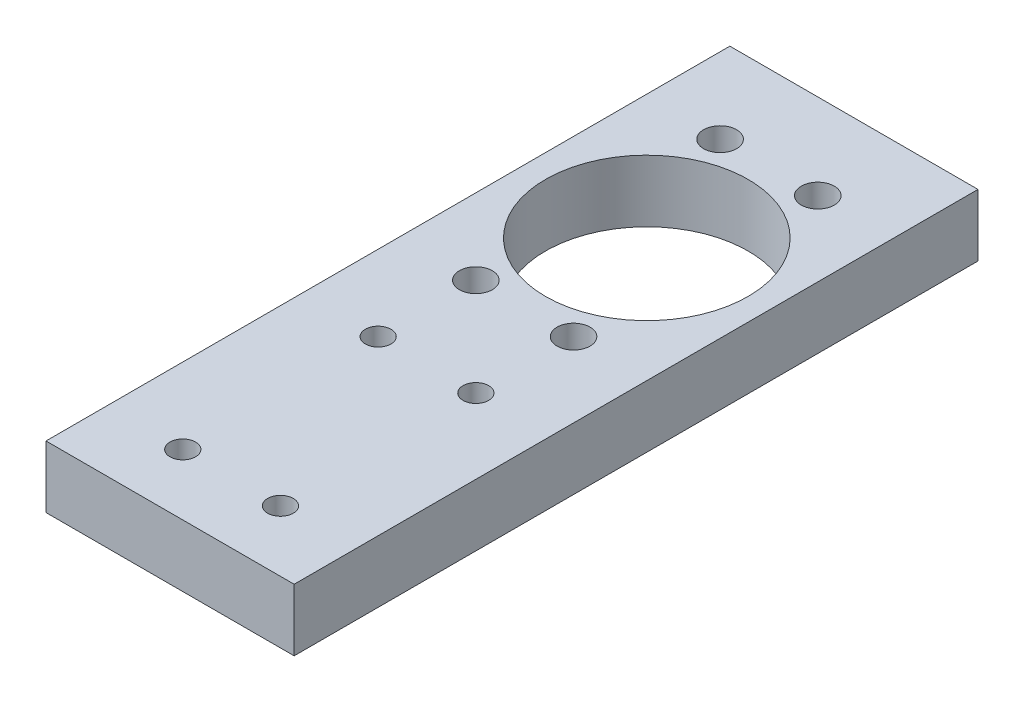
ISO-10303-21;
HEADER;
FILE_DESCRIPTION(('STEP AP214'),'2;1');
FILE_NAME('part.step','',(''),(''),'','','');
FILE_SCHEMA(('AUTOMOTIVE_DESIGN { 1 0 10303 214 1 1 1 1 }'));
ENDSEC;
DATA;
#1=APPLICATION_CONTEXT('core data for automotive mechanical design processes');
#2=APPLICATION_PROTOCOL_DEFINITION('international standard','automotive_design',2000,#1);
#3=PRODUCT_CONTEXT('',#1,'mechanical');
#4=PRODUCT('Part','Part','',(#3));
#5=PRODUCT_RELATED_PRODUCT_CATEGORY('part','',(#4));
#6=PRODUCT_DEFINITION_FORMATION('','',#4);
#7=PRODUCT_DEFINITION_CONTEXT('part definition',#1,'design');
#8=PRODUCT_DEFINITION('design','',#6,#7);
#9=PRODUCT_DEFINITION_SHAPE('','',#8);
#10=(LENGTH_UNIT() NAMED_UNIT(*) SI_UNIT(.MILLI.,.METRE.));
#11=(NAMED_UNIT(*) PLANE_ANGLE_UNIT() SI_UNIT($,.RADIAN.));
#12=(NAMED_UNIT(*) SI_UNIT($,.STERADIAN.) SOLID_ANGLE_UNIT());
#13=UNCERTAINTY_MEASURE_WITH_UNIT(LENGTH_MEASURE(1.E-05),#10,'distance_accuracy_value','');
#14=(GEOMETRIC_REPRESENTATION_CONTEXT(3) GLOBAL_UNCERTAINTY_ASSIGNED_CONTEXT((#13)) GLOBAL_UNIT_ASSIGNED_CONTEXT((#10,
#11,#12)) REPRESENTATION_CONTEXT('',''));
#15=CARTESIAN_POINT('',(0.,0.,0.));
#16=DIRECTION('',(0.,0.,1.));
#17=DIRECTION('',(1.,0.,0.));
#18=AXIS2_PLACEMENT_3D('',#15,#16,#17);
#19=CARTESIAN_POINT('',(0.,25.4,0.));
#20=DIRECTION('',(1.,0.,0.));
#21=DIRECTION('',(0.,0.,-1.));
#22=AXIS2_PLACEMENT_3D('',#19,#20,#21);
#23=PLANE('',#22);
#24=DIRECTION('',(0.,0.,1.));
#25=VECTOR('',#24,1.);
#26=CARTESIAN_POINT('',(0.,0.,0.));
#27=LINE('',#26,#25);
#28=CARTESIAN_POINT('',(0.,0.,-280.));
#29=VERTEX_POINT('',#28);
#30=CARTESIAN_POINT('',(0.,0.,0.));
#31=VERTEX_POINT('',#30);
#32=EDGE_CURVE('E96',#29,#31,#27,.T.);
#33=ORIENTED_EDGE('',*,*,#32,.T.);
#34=DIRECTION('',(0.,-1.,0.));
#35=VECTOR('',#34,1.);
#36=CARTESIAN_POINT('',(0.,25.4,0.));
#37=LINE('',#36,#35);
#38=CARTESIAN_POINT('',(0.,25.4,0.));
#39=VERTEX_POINT('',#38);
#40=EDGE_CURVE('E11',#39,#31,#37,.T.);
#41=ORIENTED_EDGE('',*,*,#40,.F.);
#42=DIRECTION('',(0.,0.,1.));
#43=VECTOR('',#42,1.);
#44=CARTESIAN_POINT('',(0.,25.4,0.));
#45=LINE('',#44,#43);
#46=CARTESIAN_POINT('',(0.,25.4,-280.));
#47=VERTEX_POINT('',#46);
#48=EDGE_CURVE('E84',#47,#39,#45,.T.);
#49=ORIENTED_EDGE('',*,*,#48,.F.);
#50=DIRECTION('',(0.,-1.,0.));
#51=VECTOR('',#50,1.);
#52=CARTESIAN_POINT('',(0.,25.4,-280.));
#53=LINE('',#52,#51);
#54=EDGE_CURVE('E92',#47,#29,#53,.T.);
#55=ORIENTED_EDGE('',*,*,#54,.T.);
#56=EDGE_LOOP('',(#33,#41,#49,#55));
#57=FACE_BOUND('',#56,.T.);
#58=ADVANCED_FACE('F33',(#57),#23,.F.);
#59=CARTESIAN_POINT('',(0.,25.4,0.));
#60=DIRECTION('',(0.,0.,-1.));
#61=DIRECTION('',(-1.,0.,0.));
#62=AXIS2_PLACEMENT_3D('',#59,#60,#61);
#63=PLANE('',#62);
#64=DIRECTION('',(1.,0.,0.));
#65=VECTOR('',#64,1.);
#66=CARTESIAN_POINT('',(0.,0.,0.));
#67=LINE('',#66,#65);
#68=CARTESIAN_POINT('',(101.6,0.,0.));
#69=VERTEX_POINT('',#68);
#70=EDGE_CURVE('E88',#31,#69,#67,.T.);
#71=ORIENTED_EDGE('',*,*,#70,.T.);
#72=DIRECTION('',(0.,-1.,0.));
#73=VECTOR('',#72,1.);
#74=CARTESIAN_POINT('',(101.6,25.4,0.));
#75=LINE('',#74,#73);
#76=CARTESIAN_POINT('',(101.6,25.4,0.));
#77=VERTEX_POINT('',#76);
#78=EDGE_CURVE('E41',#77,#69,#75,.T.);
#79=ORIENTED_EDGE('',*,*,#78,.F.);
#80=DIRECTION('',(1.,0.,0.));
#81=VECTOR('',#80,1.);
#82=CARTESIAN_POINT('',(0.,25.4,0.));
#83=LINE('',#82,#81);
#84=EDGE_CURVE('E79',#39,#77,#83,.T.);
#85=ORIENTED_EDGE('',*,*,#84,.F.);
#86=ORIENTED_EDGE('',*,*,#40,.T.);
#87=EDGE_LOOP('',(#71,#79,#85,#86));
#88=FACE_BOUND('',#87,.T.);
#89=ADVANCED_FACE('F87',(#88),#63,.F.);
#90=CARTESIAN_POINT('',(101.6,25.4,0.));
#91=DIRECTION('',(-1.,0.,0.));
#92=DIRECTION('',(0.,0.,1.));
#93=AXIS2_PLACEMENT_3D('',#90,#91,#92);
#94=PLANE('',#93);
#95=DIRECTION('',(0.,0.,-1.));
#96=VECTOR('',#95,1.);
#97=CARTESIAN_POINT('',(101.6,0.,0.));
#98=LINE('',#97,#96);
#99=CARTESIAN_POINT('',(101.6,0.,-280.));
#100=VERTEX_POINT('',#99);
#101=EDGE_CURVE('E66',#69,#100,#98,.T.);
#102=ORIENTED_EDGE('',*,*,#101,.T.);
#103=DIRECTION('',(0.,-1.,0.));
#104=VECTOR('',#103,1.);
#105=CARTESIAN_POINT('',(101.6,25.4,-280.));
#106=LINE('',#105,#104);
#107=CARTESIAN_POINT('',(101.6,25.4,-280.));
#108=VERTEX_POINT('',#107);
#109=EDGE_CURVE('E89',#108,#100,#106,.T.);
#110=ORIENTED_EDGE('',*,*,#109,.F.);
#111=DIRECTION('',(0.,0.,-1.));
#112=VECTOR('',#111,1.);
#113=CARTESIAN_POINT('',(101.6,25.4,0.));
#114=LINE('',#113,#112);
#115=EDGE_CURVE('E82',#77,#108,#114,.T.);
#116=ORIENTED_EDGE('',*,*,#115,.F.);
#117=ORIENTED_EDGE('',*,*,#78,.T.);
#118=EDGE_LOOP('',(#102,#110,#116,#117));
#119=FACE_BOUND('',#118,.T.);
#120=ADVANCED_FACE('F90',(#119),#94,.F.);
#121=CARTESIAN_POINT('',(0.,25.4,-280.));
#122=DIRECTION('',(0.,0.,1.));
#123=DIRECTION('',(1.,0.,0.));
#124=AXIS2_PLACEMENT_3D('',#121,#122,#123);
#125=PLANE('',#124);
#126=DIRECTION('',(-1.,0.,0.));
#127=VECTOR('',#126,1.);
#128=CARTESIAN_POINT('',(0.,0.,-280.));
#129=LINE('',#128,#127);
#130=EDGE_CURVE('E72',#100,#29,#129,.T.);
#131=ORIENTED_EDGE('',*,*,#130,.T.);
#132=ORIENTED_EDGE('',*,*,#54,.F.);
#133=DIRECTION('',(-1.,0.,0.));
#134=VECTOR('',#133,1.);
#135=CARTESIAN_POINT('',(0.,25.4,-280.));
#136=LINE('',#135,#134);
#137=EDGE_CURVE('E49',#108,#47,#136,.T.);
#138=ORIENTED_EDGE('',*,*,#137,.F.);
#139=ORIENTED_EDGE('',*,*,#109,.T.);
#140=EDGE_LOOP('',(#131,#132,#138,#139));
#141=FACE_BOUND('',#140,.T.);
#142=ADVANCED_FACE('F104',(#141),#125,.F.);
#143=CARTESIAN_POINT('',(0.,25.4,-280.));
#144=DIRECTION('',(0.,-1.,0.));
#145=DIRECTION('',(0.,0.,-1.));
#146=AXIS2_PLACEMENT_3D('',#143,#144,#145);
#147=PLANE('',#146);
#148=CARTESIAN_POINT('',(31.,25.4,-25.));
#149=DIRECTION('',(0.,1.,0.));
#150=DIRECTION('',(0.,0.,1.));
#151=AXIS2_PLACEMENT_3D('',#148,#149,#150);
#152=CIRCLE('',#151,5.25);
#153=CARTESIAN_POINT('',(31.,25.4,-19.75));
#154=VERTEX_POINT('',#153);
#155=EDGE_CURVE('E155',#154,#154,#152,.T.);
#156=ORIENTED_EDGE('',*,*,#155,.F.);
#157=EDGE_LOOP('',(#156));
#158=FACE_BOUND('',#157,.T.);
#159=CARTESIAN_POINT('',(71.,25.4,-25.));
#160=DIRECTION('',(0.,1.,0.));
#161=DIRECTION('',(0.,0.,1.));
#162=AXIS2_PLACEMENT_3D('',#159,#160,#161);
#163=CIRCLE('',#162,5.25);
#164=CARTESIAN_POINT('',(71.,25.4,-19.75));
#165=VERTEX_POINT('',#164);
#166=EDGE_CURVE('E149',#165,#165,#163,.T.);
#167=ORIENTED_EDGE('',*,*,#166,.F.);
#168=EDGE_LOOP('',(#167));
#169=FACE_BOUND('',#168,.T.);
#170=CARTESIAN_POINT('',(71.,25.4,-105.));
#171=DIRECTION('',(0.,1.,0.));
#172=DIRECTION('',(0.,0.,1.));
#173=AXIS2_PLACEMENT_3D('',#170,#171,#172);
#174=CIRCLE('',#173,5.25);
#175=CARTESIAN_POINT('',(71.,25.4,-99.75));
#176=VERTEX_POINT('',#175);
#177=EDGE_CURVE('E143',#176,#176,#174,.T.);
#178=ORIENTED_EDGE('',*,*,#177,.F.);
#179=EDGE_LOOP('',(#178));
#180=FACE_BOUND('',#179,.T.);
#181=CARTESIAN_POINT('',(31.,25.4,-105.));
#182=DIRECTION('',(0.,1.,0.));
#183=DIRECTION('',(0.,0.,1.));
#184=AXIS2_PLACEMENT_3D('',#181,#182,#183);
#185=CIRCLE('',#184,5.24999999999999);
#186=CARTESIAN_POINT('',(31.,25.4,-99.75));
#187=VERTEX_POINT('',#186);
#188=EDGE_CURVE('E140',#187,#187,#185,.T.);
#189=ORIENTED_EDGE('',*,*,#188,.F.);
#190=EDGE_LOOP('',(#189));
#191=FACE_BOUND('',#190,.T.);
#192=CARTESIAN_POINT('',(31.,25.4,-145.));
#193=DIRECTION('',(0.,1.,0.));
#194=DIRECTION('',(0.,0.,1.));
#195=AXIS2_PLACEMENT_3D('',#192,#193,#194);
#196=CIRCLE('',#195,6.75);
#197=CARTESIAN_POINT('',(31.,25.4,-138.25));
#198=VERTEX_POINT('',#197);
#199=EDGE_CURVE('E131',#198,#198,#196,.T.);
#200=ORIENTED_EDGE('',*,*,#199,.F.);
#201=EDGE_LOOP('',(#200));
#202=FACE_BOUND('',#201,.T.);
#203=CARTESIAN_POINT('',(71.,25.4,-145.));
#204=DIRECTION('',(0.,1.,0.));
#205=DIRECTION('',(0.,0.,1.));
#206=AXIS2_PLACEMENT_3D('',#203,#204,#205);
#207=CIRCLE('',#206,6.75);
#208=CARTESIAN_POINT('',(71.,25.4,-138.25));
#209=VERTEX_POINT('',#208);
#210=EDGE_CURVE('E125',#209,#209,#207,.T.);
#211=ORIENTED_EDGE('',*,*,#210,.F.);
#212=EDGE_LOOP('',(#211));
#213=FACE_BOUND('',#212,.T.);
#214=CARTESIAN_POINT('',(51.,25.4,-195.));
#215=DIRECTION('',(0.,1.,0.));
#216=DIRECTION('',(0.,0.,1.));
#217=AXIS2_PLACEMENT_3D('',#214,#215,#216);
#218=CIRCLE('',#217,41.5);
#219=CARTESIAN_POINT('',(51.,25.4,-153.5));
#220=VERTEX_POINT('',#219);
#221=EDGE_CURVE('E119',#220,#220,#218,.T.);
#222=ORIENTED_EDGE('',*,*,#221,.F.);
#223=EDGE_LOOP('',(#222));
#224=FACE_BOUND('',#223,.T.);
#225=CARTESIAN_POINT('',(71.,25.4,-245.));
#226=DIRECTION('',(0.,1.,0.));
#227=DIRECTION('',(0.,0.,1.));
#228=AXIS2_PLACEMENT_3D('',#225,#226,#227);
#229=CIRCLE('',#228,6.75);
#230=CARTESIAN_POINT('',(71.,25.4,-238.25));
#231=VERTEX_POINT('',#230);
#232=EDGE_CURVE('E113',#231,#231,#229,.T.);
#233=ORIENTED_EDGE('',*,*,#232,.F.);
#234=EDGE_LOOP('',(#233));
#235=FACE_BOUND('',#234,.T.);
#236=CARTESIAN_POINT('',(31.,25.4,-245.));
#237=DIRECTION('',(0.,1.,0.));
#238=DIRECTION('',(0.,0.,1.));
#239=AXIS2_PLACEMENT_3D('',#236,#237,#238);
#240=CIRCLE('',#239,6.75);
#241=CARTESIAN_POINT('',(31.,25.4,-238.25));
#242=VERTEX_POINT('',#241);
#243=EDGE_CURVE('E110',#242,#242,#240,.T.);
#244=ORIENTED_EDGE('',*,*,#243,.F.);
#245=EDGE_LOOP('',(#244));
#246=FACE_BOUND('',#245,.T.);
#247=ORIENTED_EDGE('',*,*,#48,.T.);
#248=ORIENTED_EDGE('',*,*,#84,.T.);
#249=ORIENTED_EDGE('',*,*,#115,.T.);
#250=ORIENTED_EDGE('',*,*,#137,.T.);
#251=EDGE_LOOP('',(#247,#248,#249,#250));
#252=FACE_BOUND('',#251,.T.);
#253=ADVANCED_FACE('F80',(#158,#169,#180,#191,#202,#213,#224,#235,#246,#252),#147,.F.);
#254=CARTESIAN_POINT('',(0.,0.,-280.));
#255=DIRECTION('',(0.,-1.,0.));
#256=DIRECTION('',(0.,0.,-1.));
#257=AXIS2_PLACEMENT_3D('',#254,#255,#256);
#258=PLANE('',#257);
#259=CARTESIAN_POINT('',(31.,0.,-25.));
#260=DIRECTION('',(0.,1.,0.));
#261=DIRECTION('',(0.,0.,1.));
#262=AXIS2_PLACEMENT_3D('',#259,#260,#261);
#263=CIRCLE('',#262,5.25);
#264=CARTESIAN_POINT('',(31.,0.,-19.75));
#265=VERTEX_POINT('',#264);
#266=EDGE_CURVE('E158',#265,#265,#263,.T.);
#267=ORIENTED_EDGE('',*,*,#266,.T.);
#268=EDGE_LOOP('',(#267));
#269=FACE_BOUND('',#268,.T.);
#270=CARTESIAN_POINT('',(71.,0.,-25.));
#271=DIRECTION('',(0.,1.,0.));
#272=DIRECTION('',(0.,0.,1.));
#273=AXIS2_PLACEMENT_3D('',#270,#271,#272);
#274=CIRCLE('',#273,5.25);
#275=CARTESIAN_POINT('',(71.,0.,-19.75));
#276=VERTEX_POINT('',#275);
#277=EDGE_CURVE('E152',#276,#276,#274,.T.);
#278=ORIENTED_EDGE('',*,*,#277,.T.);
#279=EDGE_LOOP('',(#278));
#280=FACE_BOUND('',#279,.T.);
#281=CARTESIAN_POINT('',(71.,0.,-105.));
#282=DIRECTION('',(0.,1.,0.));
#283=DIRECTION('',(0.,0.,1.));
#284=AXIS2_PLACEMENT_3D('',#281,#282,#283);
#285=CIRCLE('',#284,5.25);
#286=CARTESIAN_POINT('',(71.,0.,-99.75));
#287=VERTEX_POINT('',#286);
#288=EDGE_CURVE('E146',#287,#287,#285,.T.);
#289=ORIENTED_EDGE('',*,*,#288,.T.);
#290=EDGE_LOOP('',(#289));
#291=FACE_BOUND('',#290,.T.);
#292=CARTESIAN_POINT('',(31.,0.,-105.));
#293=DIRECTION('',(0.,1.,0.));
#294=DIRECTION('',(0.,0.,1.));
#295=AXIS2_PLACEMENT_3D('',#292,#293,#294);
#296=CIRCLE('',#295,5.24999999999999);
#297=CARTESIAN_POINT('',(31.,0.,-99.75));
#298=VERTEX_POINT('',#297);
#299=EDGE_CURVE('E137',#298,#298,#296,.T.);
#300=ORIENTED_EDGE('',*,*,#299,.T.);
#301=EDGE_LOOP('',(#300));
#302=FACE_BOUND('',#301,.T.);
#303=CARTESIAN_POINT('',(31.,0.,-145.));
#304=DIRECTION('',(0.,1.,0.));
#305=DIRECTION('',(0.,0.,1.));
#306=AXIS2_PLACEMENT_3D('',#303,#304,#305);
#307=CIRCLE('',#306,6.75);
#308=CARTESIAN_POINT('',(31.,0.,-138.25));
#309=VERTEX_POINT('',#308);
#310=EDGE_CURVE('E134',#309,#309,#307,.T.);
#311=ORIENTED_EDGE('',*,*,#310,.T.);
#312=EDGE_LOOP('',(#311));
#313=FACE_BOUND('',#312,.T.);
#314=CARTESIAN_POINT('',(71.,0.,-145.));
#315=DIRECTION('',(0.,1.,0.));
#316=DIRECTION('',(0.,0.,1.));
#317=AXIS2_PLACEMENT_3D('',#314,#315,#316);
#318=CIRCLE('',#317,6.75);
#319=CARTESIAN_POINT('',(71.,0.,-138.25));
#320=VERTEX_POINT('',#319);
#321=EDGE_CURVE('E128',#320,#320,#318,.T.);
#322=ORIENTED_EDGE('',*,*,#321,.T.);
#323=EDGE_LOOP('',(#322));
#324=FACE_BOUND('',#323,.T.);
#325=CARTESIAN_POINT('',(51.,0.,-195.));
#326=DIRECTION('',(0.,1.,0.));
#327=DIRECTION('',(0.,0.,1.));
#328=AXIS2_PLACEMENT_3D('',#325,#326,#327);
#329=CIRCLE('',#328,41.5);
#330=CARTESIAN_POINT('',(51.,0.,-153.5));
#331=VERTEX_POINT('',#330);
#332=EDGE_CURVE('E122',#331,#331,#329,.T.);
#333=ORIENTED_EDGE('',*,*,#332,.T.);
#334=EDGE_LOOP('',(#333));
#335=FACE_BOUND('',#334,.T.);
#336=CARTESIAN_POINT('',(71.,0.,-245.));
#337=DIRECTION('',(0.,1.,0.));
#338=DIRECTION('',(0.,0.,1.));
#339=AXIS2_PLACEMENT_3D('',#336,#337,#338);
#340=CIRCLE('',#339,6.75);
#341=CARTESIAN_POINT('',(71.,0.,-238.25));
#342=VERTEX_POINT('',#341);
#343=EDGE_CURVE('E116',#342,#342,#340,.T.);
#344=ORIENTED_EDGE('',*,*,#343,.T.);
#345=EDGE_LOOP('',(#344));
#346=FACE_BOUND('',#345,.T.);
#347=CARTESIAN_POINT('',(31.,0.,-245.));
#348=DIRECTION('',(0.,1.,0.));
#349=DIRECTION('',(0.,0.,1.));
#350=AXIS2_PLACEMENT_3D('',#347,#348,#349);
#351=CIRCLE('',#350,6.75);
#352=CARTESIAN_POINT('',(31.,0.,-238.25));
#353=VERTEX_POINT('',#352);
#354=EDGE_CURVE('E99',#353,#353,#351,.T.);
#355=ORIENTED_EDGE('',*,*,#354,.T.);
#356=EDGE_LOOP('',(#355));
#357=FACE_BOUND('',#356,.T.);
#358=ORIENTED_EDGE('',*,*,#32,.F.);
#359=ORIENTED_EDGE('',*,*,#130,.F.);
#360=ORIENTED_EDGE('',*,*,#101,.F.);
#361=ORIENTED_EDGE('',*,*,#70,.F.);
#362=EDGE_LOOP('',(#358,#359,#360,#361));
#363=FACE_BOUND('',#362,.T.);
#364=ADVANCED_FACE('F107',(#269,#280,#291,#302,#313,#324,#335,#346,#357,#363),#258,.T.);
#365=CARTESIAN_POINT('',(31.,0.,-245.));
#366=DIRECTION('',(0.,1.,0.));
#367=DIRECTION('',(0.,0.,1.));
#368=AXIS2_PLACEMENT_3D('',#365,#366,#367);
#369=CYLINDRICAL_SURFACE('',#368,6.75);
#370=ORIENTED_EDGE('',*,*,#354,.F.);
#371=EDGE_LOOP('',(#370));
#372=FACE_BOUND('',#371,.T.);
#373=ORIENTED_EDGE('',*,*,#243,.T.);
#374=EDGE_LOOP('',(#373));
#375=FACE_BOUND('',#374,.T.);
#376=ADVANCED_FACE('F185',(#372,#375),#369,.F.);
#377=CARTESIAN_POINT('',(71.,0.,-245.));
#378=DIRECTION('',(0.,1.,0.));
#379=DIRECTION('',(0.,0.,1.));
#380=AXIS2_PLACEMENT_3D('',#377,#378,#379);
#381=CYLINDRICAL_SURFACE('',#380,6.75);
#382=ORIENTED_EDGE('',*,*,#343,.F.);
#383=EDGE_LOOP('',(#382));
#384=FACE_BOUND('',#383,.T.);
#385=ORIENTED_EDGE('',*,*,#232,.T.);
#386=EDGE_LOOP('',(#385));
#387=FACE_BOUND('',#386,.T.);
#388=ADVANCED_FACE('F187',(#384,#387),#381,.F.);
#389=CARTESIAN_POINT('',(51.,0.,-195.));
#390=DIRECTION('',(0.,1.,0.));
#391=DIRECTION('',(0.,0.,1.));
#392=AXIS2_PLACEMENT_3D('',#389,#390,#391);
#393=CYLINDRICAL_SURFACE('',#392,41.5);
#394=ORIENTED_EDGE('',*,*,#332,.F.);
#395=EDGE_LOOP('',(#394));
#396=FACE_BOUND('',#395,.T.);
#397=ORIENTED_EDGE('',*,*,#221,.T.);
#398=EDGE_LOOP('',(#397));
#399=FACE_BOUND('',#398,.T.);
#400=ADVANCED_FACE('F194',(#396,#399),#393,.F.);
#401=CARTESIAN_POINT('',(71.,0.,-145.));
#402=DIRECTION('',(0.,1.,0.));
#403=DIRECTION('',(0.,0.,1.));
#404=AXIS2_PLACEMENT_3D('',#401,#402,#403);
#405=CYLINDRICAL_SURFACE('',#404,6.75);
#406=ORIENTED_EDGE('',*,*,#321,.F.);
#407=EDGE_LOOP('',(#406));
#408=FACE_BOUND('',#407,.T.);
#409=ORIENTED_EDGE('',*,*,#210,.T.);
#410=EDGE_LOOP('',(#409));
#411=FACE_BOUND('',#410,.T.);
#412=ADVANCED_FACE('F273',(#408,#411),#405,.F.);
#413=CARTESIAN_POINT('',(31.,0.,-145.));
#414=DIRECTION('',(0.,1.,0.));
#415=DIRECTION('',(0.,0.,1.));
#416=AXIS2_PLACEMENT_3D('',#413,#414,#415);
#417=CYLINDRICAL_SURFACE('',#416,6.75);
#418=ORIENTED_EDGE('',*,*,#310,.F.);
#419=EDGE_LOOP('',(#418));
#420=FACE_BOUND('',#419,.T.);
#421=ORIENTED_EDGE('',*,*,#199,.T.);
#422=EDGE_LOOP('',(#421));
#423=FACE_BOUND('',#422,.T.);
#424=ADVANCED_FACE('F235',(#420,#423),#417,.F.);
#425=CARTESIAN_POINT('',(31.,0.,-105.));
#426=DIRECTION('',(0.,1.,0.));
#427=DIRECTION('',(0.,0.,1.));
#428=AXIS2_PLACEMENT_3D('',#425,#426,#427);
#429=CYLINDRICAL_SURFACE('',#428,5.24999999999999);
#430=ORIENTED_EDGE('',*,*,#299,.F.);
#431=EDGE_LOOP('',(#430));
#432=FACE_BOUND('',#431,.T.);
#433=ORIENTED_EDGE('',*,*,#188,.T.);
#434=EDGE_LOOP('',(#433));
#435=FACE_BOUND('',#434,.T.);
#436=ADVANCED_FACE('F229',(#432,#435),#429,.F.);
#437=CARTESIAN_POINT('',(71.,0.,-105.));
#438=DIRECTION('',(0.,1.,0.));
#439=DIRECTION('',(0.,0.,1.));
#440=AXIS2_PLACEMENT_3D('',#437,#438,#439);
#441=CYLINDRICAL_SURFACE('',#440,5.25);
#442=ORIENTED_EDGE('',*,*,#288,.F.);
#443=EDGE_LOOP('',(#442));
#444=FACE_BOUND('',#443,.T.);
#445=ORIENTED_EDGE('',*,*,#177,.T.);
#446=EDGE_LOOP('',(#445));
#447=FACE_BOUND('',#446,.T.);
#448=ADVANCED_FACE('F234',(#444,#447),#441,.F.);
#449=CARTESIAN_POINT('',(71.,0.,-25.));
#450=DIRECTION('',(0.,1.,0.));
#451=DIRECTION('',(0.,0.,1.));
#452=AXIS2_PLACEMENT_3D('',#449,#450,#451);
#453=CYLINDRICAL_SURFACE('',#452,5.25);
#454=ORIENTED_EDGE('',*,*,#277,.F.);
#455=EDGE_LOOP('',(#454));
#456=FACE_BOUND('',#455,.T.);
#457=ORIENTED_EDGE('',*,*,#166,.T.);
#458=EDGE_LOOP('',(#457));
#459=FACE_BOUND('',#458,.T.);
#460=ADVANCED_FACE('F247',(#456,#459),#453,.F.);
#461=CARTESIAN_POINT('',(31.,0.,-25.));
#462=DIRECTION('',(0.,1.,0.));
#463=DIRECTION('',(0.,0.,1.));
#464=AXIS2_PLACEMENT_3D('',#461,#462,#463);
#465=CYLINDRICAL_SURFACE('',#464,5.25);
#466=ORIENTED_EDGE('',*,*,#266,.F.);
#467=EDGE_LOOP('',(#466));
#468=FACE_BOUND('',#467,.T.);
#469=ORIENTED_EDGE('',*,*,#155,.T.);
#470=EDGE_LOOP('',(#469));
#471=FACE_BOUND('',#470,.T.);
#472=ADVANCED_FACE('F164',(#468,#471),#465,.F.);
#473=CLOSED_SHELL('',(#58,#89,#120,#142,#253,#364,#376,#388,#400,#412,#424,#436,#448,#460,#472));
#474=MANIFOLD_SOLID_BREP('B2',#473);
#475=ADVANCED_BREP_SHAPE_REPRESENTATION('',(#18,#474),#14);
#476=SHAPE_DEFINITION_REPRESENTATION(#9,#475);
ENDSEC;
END-ISO-10303-21;
